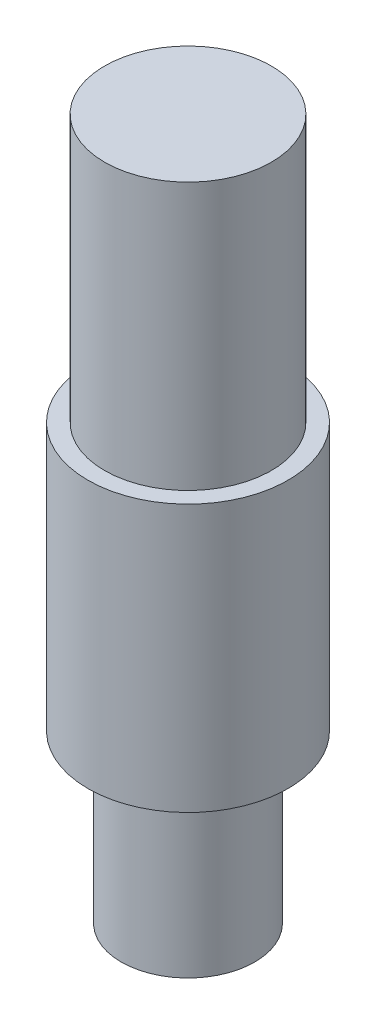
ISO-10303-21;
HEADER;
FILE_DESCRIPTION(('STEP AP214'),'2;1');
FILE_NAME('part.step','',(''),(''),'','','');
FILE_SCHEMA(('AUTOMOTIVE_DESIGN { 1 0 10303 214 1 1 1 1 }'));
ENDSEC;
DATA;
#1=APPLICATION_CONTEXT('core data for automotive mechanical design processes');
#2=APPLICATION_PROTOCOL_DEFINITION('international standard','automotive_design',2000,#1);
#3=PRODUCT_CONTEXT('',#1,'mechanical');
#4=PRODUCT('Part','Part','',(#3));
#5=PRODUCT_RELATED_PRODUCT_CATEGORY('part','',(#4));
#6=PRODUCT_DEFINITION_FORMATION('','',#4);
#7=PRODUCT_DEFINITION_CONTEXT('part definition',#1,'design');
#8=PRODUCT_DEFINITION('design','',#6,#7);
#9=PRODUCT_DEFINITION_SHAPE('','',#8);
#10=(LENGTH_UNIT() NAMED_UNIT(*) SI_UNIT(.MILLI.,.METRE.));
#11=(NAMED_UNIT(*) PLANE_ANGLE_UNIT() SI_UNIT($,.RADIAN.));
#12=(NAMED_UNIT(*) SI_UNIT($,.STERADIAN.) SOLID_ANGLE_UNIT());
#13=UNCERTAINTY_MEASURE_WITH_UNIT(LENGTH_MEASURE(1.E-05),#10,'distance_accuracy_value','');
#14=(GEOMETRIC_REPRESENTATION_CONTEXT(3) GLOBAL_UNCERTAINTY_ASSIGNED_CONTEXT((#13)) GLOBAL_UNIT_ASSIGNED_CONTEXT((#10,
#11,#12)) REPRESENTATION_CONTEXT('',''));
#15=CARTESIAN_POINT('',(0.,0.,0.));
#16=DIRECTION('',(0.,0.,1.));
#17=DIRECTION('',(1.,0.,0.));
#18=AXIS2_PLACEMENT_3D('',#15,#16,#17);
#19=CARTESIAN_POINT('',(0.,25.,0.));
#20=DIRECTION('',(0.,-1.,0.));
#21=DIRECTION('',(0.,0.,-1.));
#22=AXIS2_PLACEMENT_3D('',#19,#20,#21);
#23=CYLINDRICAL_SURFACE('',#22,10.);
#24=CARTESIAN_POINT('',(0.,25.,0.));
#25=DIRECTION('',(0.,1.,0.));
#26=DIRECTION('',(0.,0.,1.));
#27=AXIS2_PLACEMENT_3D('',#24,#25,#26);
#28=CIRCLE('',#27,10.);
#29=CARTESIAN_POINT('',(0.,25.,10.));
#30=VERTEX_POINT('',#29);
#31=EDGE_CURVE('E44',#30,#30,#28,.T.);
#32=ORIENTED_EDGE('',*,*,#31,.F.);
#33=EDGE_LOOP('',(#32));
#34=FACE_BOUND('',#33,.T.);
#35=CARTESIAN_POINT('',(0.,0.,0.));
#36=DIRECTION('',(0.,1.,0.));
#37=DIRECTION('',(0.,0.,1.));
#38=AXIS2_PLACEMENT_3D('',#35,#36,#37);
#39=CIRCLE('',#38,10.);
#40=CARTESIAN_POINT('',(0.,0.,10.));
#41=VERTEX_POINT('',#40);
#42=EDGE_CURVE('E39',#41,#41,#39,.T.);
#43=ORIENTED_EDGE('',*,*,#42,.T.);
#44=EDGE_LOOP('',(#43));
#45=FACE_BOUND('',#44,.T.);
#46=ADVANCED_FACE('F36',(#34,#45),#23,.T.);
#47=CARTESIAN_POINT('',(0.,0.,0.));
#48=DIRECTION('',(0.,1.,0.));
#49=DIRECTION('',(0.,0.,1.));
#50=AXIS2_PLACEMENT_3D('',#47,#48,#49);
#51=PLANE('',#50);
#52=ORIENTED_EDGE('',*,*,#42,.F.);
#53=EDGE_LOOP('',(#52));
#54=FACE_BOUND('',#53,.T.);
#55=ADVANCED_FACE('F85',(#54),#51,.F.);
#56=CARTESIAN_POINT('',(0.,65.,0.));
#57=DIRECTION('',(0.,-1.,0.));
#58=DIRECTION('',(0.,0.,-1.));
#59=AXIS2_PLACEMENT_3D('',#56,#57,#58);
#60=CYLINDRICAL_SURFACE('',#59,14.99);
#61=CARTESIAN_POINT('',(0.,65.,0.));
#62=DIRECTION('',(0.,1.,0.));
#63=DIRECTION('',(0.,0.,1.));
#64=AXIS2_PLACEMENT_3D('',#61,#62,#63);
#65=CIRCLE('',#64,14.99);
#66=CARTESIAN_POINT('',(0.,65.,14.99));
#67=VERTEX_POINT('',#66);
#68=EDGE_CURVE('E54',#67,#67,#65,.T.);
#69=ORIENTED_EDGE('',*,*,#68,.F.);
#70=EDGE_LOOP('',(#69));
#71=FACE_BOUND('',#70,.T.);
#72=CARTESIAN_POINT('',(0.,25.,0.));
#73=DIRECTION('',(0.,1.,0.));
#74=DIRECTION('',(0.,0.,1.));
#75=AXIS2_PLACEMENT_3D('',#72,#73,#74);
#76=CIRCLE('',#75,14.99);
#77=CARTESIAN_POINT('',(0.,25.,14.99));
#78=VERTEX_POINT('',#77);
#79=EDGE_CURVE('E58',#78,#78,#76,.T.);
#80=ORIENTED_EDGE('',*,*,#79,.T.);
#81=EDGE_LOOP('',(#80));
#82=FACE_BOUND('',#81,.T.);
#83=ADVANCED_FACE('F90',(#71,#82),#60,.T.);
#84=CARTESIAN_POINT('',(0.,65.,0.));
#85=DIRECTION('',(0.,1.,0.));
#86=DIRECTION('',(0.,0.,1.));
#87=AXIS2_PLACEMENT_3D('',#84,#85,#86);
#88=PLANE('',#87);
#89=CARTESIAN_POINT('',(0.,65.,0.));
#90=DIRECTION('',(0.,1.,0.));
#91=DIRECTION('',(0.,0.,1.));
#92=AXIS2_PLACEMENT_3D('',#89,#90,#91);
#93=CIRCLE('',#92,12.49);
#94=CARTESIAN_POINT('',(0.,65.,12.49));
#95=VERTEX_POINT('',#94);
#96=EDGE_CURVE('E10',#95,#95,#93,.T.);
#97=ORIENTED_EDGE('',*,*,#96,.F.);
#98=EDGE_LOOP('',(#97));
#99=FACE_BOUND('',#98,.T.);
#100=ORIENTED_EDGE('',*,*,#68,.T.);
#101=EDGE_LOOP('',(#100));
#102=FACE_BOUND('',#101,.T.);
#103=ADVANCED_FACE('F80',(#99,#102),#88,.T.);
#104=CARTESIAN_POINT('',(0.,25.,0.));
#105=DIRECTION('',(0.,1.,0.));
#106=DIRECTION('',(0.,0.,1.));
#107=AXIS2_PLACEMENT_3D('',#104,#105,#106);
#108=PLANE('',#107);
#109=ORIENTED_EDGE('',*,*,#31,.T.);
#110=EDGE_LOOP('',(#109));
#111=FACE_BOUND('',#110,.T.);
#112=ORIENTED_EDGE('',*,*,#79,.F.);
#113=EDGE_LOOP('',(#112));
#114=FACE_BOUND('',#113,.T.);
#115=ADVANCED_FACE('F73',(#111,#114),#108,.F.);
#116=CARTESIAN_POINT('',(0.,105.,0.));
#117=DIRECTION('',(0.,-1.,0.));
#118=DIRECTION('',(0.,0.,-1.));
#119=AXIS2_PLACEMENT_3D('',#116,#117,#118);
#120=CYLINDRICAL_SURFACE('',#119,12.49);
#121=CARTESIAN_POINT('',(0.,105.,0.));
#122=DIRECTION('',(0.,1.,0.));
#123=DIRECTION('',(0.,0.,1.));
#124=AXIS2_PLACEMENT_3D('',#121,#122,#123);
#125=CIRCLE('',#124,12.49);
#126=CARTESIAN_POINT('',(0.,105.,12.49));
#127=VERTEX_POINT('',#126);
#128=EDGE_CURVE('E53',#127,#127,#125,.T.);
#129=ORIENTED_EDGE('',*,*,#128,.F.);
#130=EDGE_LOOP('',(#129));
#131=FACE_BOUND('',#130,.T.);
#132=ORIENTED_EDGE('',*,*,#96,.T.);
#133=EDGE_LOOP('',(#132));
#134=FACE_BOUND('',#133,.T.);
#135=ADVANCED_FACE('F71',(#131,#134),#120,.T.);
#136=CARTESIAN_POINT('',(0.,105.,0.));
#137=DIRECTION('',(0.,1.,0.));
#138=DIRECTION('',(0.,0.,1.));
#139=AXIS2_PLACEMENT_3D('',#136,#137,#138);
#140=PLANE('',#139);
#141=ORIENTED_EDGE('',*,*,#128,.T.);
#142=EDGE_LOOP('',(#141));
#143=FACE_BOUND('',#142,.T.);
#144=ADVANCED_FACE('F69',(#143),#140,.T.);
#145=CLOSED_SHELL('',(#46,#55,#83,#103,#115,#135,#144));
#146=MANIFOLD_SOLID_BREP('B2',#145);
#147=ADVANCED_BREP_SHAPE_REPRESENTATION('',(#18,#146),#14);
#148=SHAPE_DEFINITION_REPRESENTATION(#9,#147);
ENDSEC;
END-ISO-10303-21;
